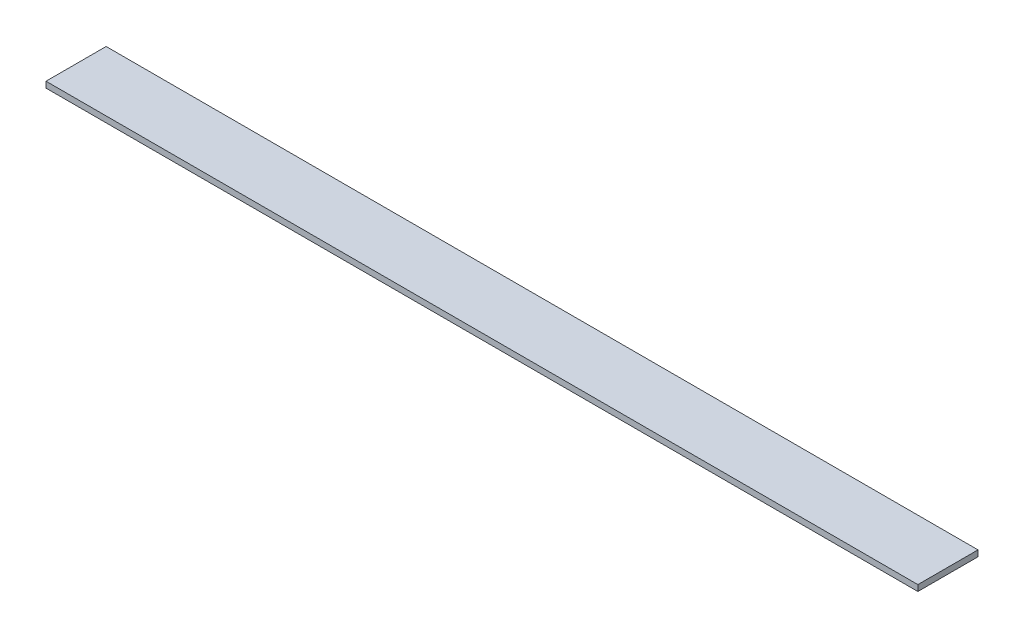
ISO-10303-21;
HEADER;
FILE_DESCRIPTION(('STEP AP214'),'2;1');
FILE_NAME('part.step','',(''),(''),'','','');
FILE_SCHEMA(('AUTOMOTIVE_DESIGN { 1 0 10303 214 1 1 1 1 }'));
ENDSEC;
DATA;
#1=APPLICATION_CONTEXT('core data for automotive mechanical design processes');
#2=APPLICATION_PROTOCOL_DEFINITION('international standard','automotive_design',2000,#1);
#3=PRODUCT_CONTEXT('',#1,'mechanical');
#4=PRODUCT('Part','Part','',(#3));
#5=PRODUCT_RELATED_PRODUCT_CATEGORY('part','',(#4));
#6=PRODUCT_DEFINITION_FORMATION('','',#4);
#7=PRODUCT_DEFINITION_CONTEXT('part definition',#1,'design');
#8=PRODUCT_DEFINITION('design','',#6,#7);
#9=PRODUCT_DEFINITION_SHAPE('','',#8);
#10=(LENGTH_UNIT() NAMED_UNIT(*) SI_UNIT(.MILLI.,.METRE.));
#11=(NAMED_UNIT(*) PLANE_ANGLE_UNIT() SI_UNIT($,.RADIAN.));
#12=(NAMED_UNIT(*) SI_UNIT($,.STERADIAN.) SOLID_ANGLE_UNIT());
#13=UNCERTAINTY_MEASURE_WITH_UNIT(LENGTH_MEASURE(1.E-05),#10,'distance_accuracy_value','');
#14=(GEOMETRIC_REPRESENTATION_CONTEXT(3) GLOBAL_UNCERTAINTY_ASSIGNED_CONTEXT((#13)) GLOBAL_UNIT_ASSIGNED_CONTEXT((#10,
#11,#12)) REPRESENTATION_CONTEXT('',''));
#15=CARTESIAN_POINT('',(0.,0.,0.));
#16=DIRECTION('',(0.,0.,1.));
#17=DIRECTION('',(1.,0.,0.));
#18=AXIS2_PLACEMENT_3D('',#15,#16,#17);
#19=CARTESIAN_POINT('',(0.,10.,0.));
#20=DIRECTION('',(1.,0.,0.));
#21=DIRECTION('',(0.,0.,-1.));
#22=AXIS2_PLACEMENT_3D('',#19,#20,#21);
#23=PLANE('',#22);
#24=DIRECTION('',(0.,0.,1.));
#25=VECTOR('',#24,1.);
#26=CARTESIAN_POINT('',(0.,0.,0.));
#27=LINE('',#26,#25);
#28=CARTESIAN_POINT('',(0.,0.,-100.));
#29=VERTEX_POINT('',#28);
#30=CARTESIAN_POINT('',(0.,0.,0.));
#31=VERTEX_POINT('',#30);
#32=EDGE_CURVE('E94',#29,#31,#27,.T.);
#33=ORIENTED_EDGE('',*,*,#32,.T.);
#34=DIRECTION('',(0.,-1.,0.));
#35=VECTOR('',#34,1.);
#36=CARTESIAN_POINT('',(0.,10.,0.));
#37=LINE('',#36,#35);
#38=CARTESIAN_POINT('',(0.,10.,0.));
#39=VERTEX_POINT('',#38);
#40=EDGE_CURVE('E11',#39,#31,#37,.T.);
#41=ORIENTED_EDGE('',*,*,#40,.F.);
#42=DIRECTION('',(0.,0.,1.));
#43=VECTOR('',#42,1.);
#44=CARTESIAN_POINT('',(0.,10.,0.));
#45=LINE('',#44,#43);
#46=CARTESIAN_POINT('',(0.,10.,-100.));
#47=VERTEX_POINT('',#46);
#48=EDGE_CURVE('E82',#47,#39,#45,.T.);
#49=ORIENTED_EDGE('',*,*,#48,.F.);
#50=DIRECTION('',(0.,-1.,0.));
#51=VECTOR('',#50,1.);
#52=CARTESIAN_POINT('',(0.,10.,-100.));
#53=LINE('',#52,#51);
#54=EDGE_CURVE('E90',#47,#29,#53,.T.);
#55=ORIENTED_EDGE('',*,*,#54,.T.);
#56=EDGE_LOOP('',(#33,#41,#49,#55));
#57=FACE_BOUND('',#56,.T.);
#58=ADVANCED_FACE('F31',(#57),#23,.F.);
#59=CARTESIAN_POINT('',(0.,10.,0.));
#60=DIRECTION('',(0.,0.,-1.));
#61=DIRECTION('',(-1.,0.,0.));
#62=AXIS2_PLACEMENT_3D('',#59,#60,#61);
#63=PLANE('',#62);
#64=DIRECTION('',(1.,0.,0.));
#65=VECTOR('',#64,1.);
#66=CARTESIAN_POINT('',(0.,0.,0.));
#67=LINE('',#66,#65);
#68=CARTESIAN_POINT('',(1450.,0.,0.));
#69=VERTEX_POINT('',#68);
#70=EDGE_CURVE('E86',#31,#69,#67,.T.);
#71=ORIENTED_EDGE('',*,*,#70,.T.);
#72=DIRECTION('',(0.,-1.,0.));
#73=VECTOR('',#72,1.);
#74=CARTESIAN_POINT('',(1450.,10.,0.));
#75=LINE('',#74,#73);
#76=CARTESIAN_POINT('',(1450.,10.,0.));
#77=VERTEX_POINT('',#76);
#78=EDGE_CURVE('E39',#77,#69,#75,.T.);
#79=ORIENTED_EDGE('',*,*,#78,.F.);
#80=DIRECTION('',(1.,0.,0.));
#81=VECTOR('',#80,1.);
#82=CARTESIAN_POINT('',(0.,10.,0.));
#83=LINE('',#82,#81);
#84=EDGE_CURVE('E77',#39,#77,#83,.T.);
#85=ORIENTED_EDGE('',*,*,#84,.F.);
#86=ORIENTED_EDGE('',*,*,#40,.T.);
#87=EDGE_LOOP('',(#71,#79,#85,#86));
#88=FACE_BOUND('',#87,.T.);
#89=ADVANCED_FACE('F85',(#88),#63,.F.);
#90=CARTESIAN_POINT('',(1450.,10.,0.));
#91=DIRECTION('',(-1.,0.,0.));
#92=DIRECTION('',(0.,0.,1.));
#93=AXIS2_PLACEMENT_3D('',#90,#91,#92);
#94=PLANE('',#93);
#95=DIRECTION('',(0.,0.,-1.));
#96=VECTOR('',#95,1.);
#97=CARTESIAN_POINT('',(1450.,0.,0.));
#98=LINE('',#97,#96);
#99=CARTESIAN_POINT('',(1450.,0.,-100.));
#100=VERTEX_POINT('',#99);
#101=EDGE_CURVE('E64',#69,#100,#98,.T.);
#102=ORIENTED_EDGE('',*,*,#101,.T.);
#103=DIRECTION('',(0.,-1.,0.));
#104=VECTOR('',#103,1.);
#105=CARTESIAN_POINT('',(1450.,10.,-100.));
#106=LINE('',#105,#104);
#107=CARTESIAN_POINT('',(1450.,10.,-100.));
#108=VERTEX_POINT('',#107);
#109=EDGE_CURVE('E87',#108,#100,#106,.T.);
#110=ORIENTED_EDGE('',*,*,#109,.F.);
#111=DIRECTION('',(0.,0.,-1.));
#112=VECTOR('',#111,1.);
#113=CARTESIAN_POINT('',(1450.,10.,0.));
#114=LINE('',#113,#112);
#115=EDGE_CURVE('E80',#77,#108,#114,.T.);
#116=ORIENTED_EDGE('',*,*,#115,.F.);
#117=ORIENTED_EDGE('',*,*,#78,.T.);
#118=EDGE_LOOP('',(#102,#110,#116,#117));
#119=FACE_BOUND('',#118,.T.);
#120=ADVANCED_FACE('F88',(#119),#94,.F.);
#121=CARTESIAN_POINT('',(0.,10.,-100.));
#122=DIRECTION('',(0.,0.,1.));
#123=DIRECTION('',(1.,0.,0.));
#124=AXIS2_PLACEMENT_3D('',#121,#122,#123);
#125=PLANE('',#124);
#126=DIRECTION('',(-1.,0.,0.));
#127=VECTOR('',#126,1.);
#128=CARTESIAN_POINT('',(0.,0.,-100.));
#129=LINE('',#128,#127);
#130=EDGE_CURVE('E70',#100,#29,#129,.T.);
#131=ORIENTED_EDGE('',*,*,#130,.T.);
#132=ORIENTED_EDGE('',*,*,#54,.F.);
#133=DIRECTION('',(-1.,0.,0.));
#134=VECTOR('',#133,1.);
#135=CARTESIAN_POINT('',(0.,10.,-100.));
#136=LINE('',#135,#134);
#137=EDGE_CURVE('E47',#108,#47,#136,.T.);
#138=ORIENTED_EDGE('',*,*,#137,.F.);
#139=ORIENTED_EDGE('',*,*,#109,.T.);
#140=EDGE_LOOP('',(#131,#132,#138,#139));
#141=FACE_BOUND('',#140,.T.);
#142=ADVANCED_FACE('F101',(#141),#125,.F.);
#143=CARTESIAN_POINT('',(0.,10.,-100.));
#144=DIRECTION('',(0.,-1.,0.));
#145=DIRECTION('',(0.,0.,-1.));
#146=AXIS2_PLACEMENT_3D('',#143,#144,#145);
#147=PLANE('',#146);
#148=ORIENTED_EDGE('',*,*,#48,.T.);
#149=ORIENTED_EDGE('',*,*,#84,.T.);
#150=ORIENTED_EDGE('',*,*,#115,.T.);
#151=ORIENTED_EDGE('',*,*,#137,.T.);
#152=EDGE_LOOP('',(#148,#149,#150,#151));
#153=FACE_BOUND('',#152,.T.);
#154=ADVANCED_FACE('F78',(#153),#147,.F.);
#155=CARTESIAN_POINT('',(0.,0.,-100.));
#156=DIRECTION('',(0.,-1.,0.));
#157=DIRECTION('',(0.,0.,-1.));
#158=AXIS2_PLACEMENT_3D('',#155,#156,#157);
#159=PLANE('',#158);
#160=ORIENTED_EDGE('',*,*,#32,.F.);
#161=ORIENTED_EDGE('',*,*,#130,.F.);
#162=ORIENTED_EDGE('',*,*,#101,.F.);
#163=ORIENTED_EDGE('',*,*,#70,.F.);
#164=EDGE_LOOP('',(#160,#161,#162,#163));
#165=FACE_BOUND('',#164,.T.);
#166=ADVANCED_FACE('F104',(#165),#159,.T.);
#167=CLOSED_SHELL('',(#58,#89,#120,#142,#154,#166));
#168=MANIFOLD_SOLID_BREP('B2',#167);
#169=ADVANCED_BREP_SHAPE_REPRESENTATION('',(#18,#168),#14);
#170=SHAPE_DEFINITION_REPRESENTATION(#9,#169);
ENDSEC;
END-ISO-10303-21;
